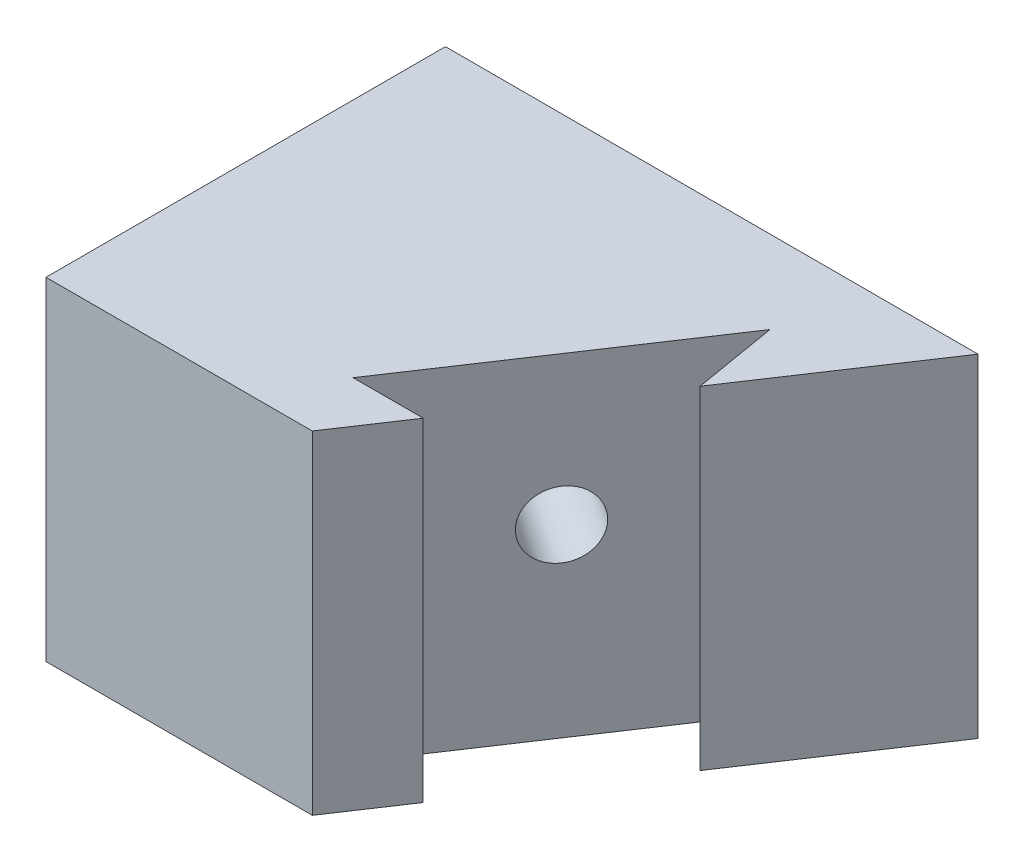
ISO-10303-21;
HEADER;
FILE_DESCRIPTION(('STEP AP214'),'2;1');
FILE_NAME('part.step','',(''),(''),'','','');
FILE_SCHEMA(('AUTOMOTIVE_DESIGN { 1 0 10303 214 1 1 1 1 }'));
ENDSEC;
DATA;
#1=APPLICATION_CONTEXT('core data for automotive mechanical design processes');
#2=APPLICATION_PROTOCOL_DEFINITION('international standard','automotive_design',2000,#1);
#3=PRODUCT_CONTEXT('',#1,'mechanical');
#4=PRODUCT('Part','Part','',(#3));
#5=PRODUCT_RELATED_PRODUCT_CATEGORY('part','',(#4));
#6=PRODUCT_DEFINITION_FORMATION('','',#4);
#7=PRODUCT_DEFINITION_CONTEXT('part definition',#1,'design');
#8=PRODUCT_DEFINITION('design','',#6,#7);
#9=PRODUCT_DEFINITION_SHAPE('','',#8);
#10=(LENGTH_UNIT() NAMED_UNIT(*) SI_UNIT(.MILLI.,.METRE.));
#11=(NAMED_UNIT(*) PLANE_ANGLE_UNIT() SI_UNIT($,.RADIAN.));
#12=(NAMED_UNIT(*) SI_UNIT($,.STERADIAN.) SOLID_ANGLE_UNIT());
#13=UNCERTAINTY_MEASURE_WITH_UNIT(LENGTH_MEASURE(1.E-05),#10,'distance_accuracy_value','');
#14=(GEOMETRIC_REPRESENTATION_CONTEXT(3) GLOBAL_UNCERTAINTY_ASSIGNED_CONTEXT((#13)) GLOBAL_UNIT_ASSIGNED_CONTEXT((#10,
#11,#12)) REPRESENTATION_CONTEXT('',''));
#15=CARTESIAN_POINT('',(0.,0.,0.));
#16=DIRECTION('',(0.,0.,1.));
#17=DIRECTION('',(1.,0.,0.));
#18=AXIS2_PLACEMENT_3D('',#15,#16,#17);
#19=CARTESIAN_POINT('',(0.,0.,30.));
#20=DIRECTION('',(0.832050294337844,0.,0.554700196225229));
#21=DIRECTION('',(0.554700196225229,0.,-0.832050294337844));
#22=AXIS2_PLACEMENT_3D('',#19,#20,#21);
#23=PLANE('',#22);
#24=DIRECTION('',(0.,1.,0.));
#25=VECTOR('',#24,1.);
#26=CARTESIAN_POINT('',(6.66666666666667,0.,20.));
#27=LINE('',#26,#25);
#28=CARTESIAN_POINT('',(6.66666666666667,0.,20.));
#29=VERTEX_POINT('',#28);
#30=CARTESIAN_POINT('',(6.66666666666667,50.,20.));
#31=VERTEX_POINT('',#30);
#32=EDGE_CURVE('E157',#29,#31,#27,.T.);
#33=ORIENTED_EDGE('',*,*,#32,.T.);
#34=DIRECTION('',(0.554700196225229,0.,-0.832050294337844));
#35=VECTOR('',#34,1.);
#36=CARTESIAN_POINT('',(0.,50.,30.));
#37=LINE('',#36,#35);
#38=CARTESIAN_POINT('',(0.,50.,30.));
#39=VERTEX_POINT('',#38);
#40=EDGE_CURVE('E143',#39,#31,#37,.T.);
#41=ORIENTED_EDGE('',*,*,#40,.F.);
#42=DIRECTION('',(0.,1.,0.));
#43=VECTOR('',#42,1.);
#44=CARTESIAN_POINT('',(0.,0.,30.));
#45=LINE('',#44,#43);
#46=CARTESIAN_POINT('',(0.,0.,30.));
#47=VERTEX_POINT('',#46);
#48=EDGE_CURVE('E135',#47,#39,#45,.T.);
#49=ORIENTED_EDGE('',*,*,#48,.F.);
#50=DIRECTION('',(0.554700196225229,0.,-0.832050294337844));
#51=VECTOR('',#50,1.);
#52=CARTESIAN_POINT('',(0.,0.,30.));
#53=LINE('',#52,#51);
#54=EDGE_CURVE('E142',#47,#29,#53,.T.);
#55=ORIENTED_EDGE('',*,*,#54,.T.);
#56=EDGE_LOOP('',(#33,#41,#49,#55));
#57=FACE_BOUND('',#56,.T.);
#58=ADVANCED_FACE('F36',(#57),#23,.T.);
#59=CARTESIAN_POINT('',(-40.,50.,30.));
#60=DIRECTION('',(0.,0.,-1.));
#61=DIRECTION('',(-1.,0.,0.));
#62=AXIS2_PLACEMENT_3D('',#59,#60,#61);
#63=PLANE('',#62);
#64=ORIENTED_EDGE('',*,*,#48,.T.);
#65=DIRECTION('',(1.,0.,0.));
#66=VECTOR('',#65,1.);
#67=CARTESIAN_POINT('',(-40.,50.,30.));
#68=LINE('',#67,#66);
#69=CARTESIAN_POINT('',(-40.,50.,30.));
#70=VERTEX_POINT('',#69);
#71=EDGE_CURVE('E126',#70,#39,#68,.T.);
#72=ORIENTED_EDGE('',*,*,#71,.F.);
#73=DIRECTION('',(0.,-1.,0.));
#74=VECTOR('',#73,1.);
#75=CARTESIAN_POINT('',(-40.,50.,30.));
#76=LINE('',#75,#74);
#77=CARTESIAN_POINT('',(-40.,0.,30.));
#78=VERTEX_POINT('',#77);
#79=EDGE_CURVE('E122',#70,#78,#76,.T.);
#80=ORIENTED_EDGE('',*,*,#79,.T.);
#81=DIRECTION('',(1.,0.,0.));
#82=VECTOR('',#81,1.);
#83=CARTESIAN_POINT('',(-40.,0.,30.));
#84=LINE('',#83,#82);
#85=EDGE_CURVE('E127',#78,#47,#84,.T.);
#86=ORIENTED_EDGE('',*,*,#85,.T.);
#87=EDGE_LOOP('',(#64,#72,#80,#86));
#88=FACE_BOUND('',#87,.T.);
#89=ADVANCED_FACE('F198',(#88),#63,.F.);
#90=CARTESIAN_POINT('',(0.,50.,0.));
#91=DIRECTION('',(0.,1.,0.));
#92=DIRECTION('',(0.,0.,1.));
#93=AXIS2_PLACEMENT_3D('',#90,#91,#92);
#94=PLANE('',#93);
#95=DIRECTION('',(1.,0.,0.));
#96=VECTOR('',#95,1.);
#97=CARTESIAN_POINT('',(-3.87129213186939,50.,20.));
#98=LINE('',#97,#96);
#99=CARTESIAN_POINT('',(-3.87129213186939,50.,20.));
#100=VERTEX_POINT('',#99);
#101=EDGE_CURVE('E160',#100,#31,#98,.T.);
#102=ORIENTED_EDGE('',*,*,#101,.F.);
#103=DIRECTION('',(-0.554700196225229,0.,0.832050294337844));
#104=VECTOR('',#103,1.);
#105=CARTESIAN_POINT('',(21.1779297543231,50.,-17.5738328292888));
#106=LINE('',#105,#104);
#107=CARTESIAN_POINT('',(21.1779297543231,50.,-17.5738328292888));
#108=VERTEX_POINT('',#107);
#109=EDGE_CURVE('E162',#108,#100,#106,.T.);
#110=ORIENTED_EDGE('',*,*,#109,.F.);
#111=DIRECTION('',(-0.166504836703689,0.,-0.986040637780349));
#112=VECTOR('',#111,1.);
#113=CARTESIAN_POINT('',(23.3076725534235,50.,-4.96150883013532));
#114=LINE('',#113,#112);
#115=CARTESIAN_POINT('',(23.3076725534235,50.,-4.96150883013532));
#116=VERTEX_POINT('',#115);
#117=EDGE_CURVE('E117',#116,#108,#114,.T.);
#118=ORIENTED_EDGE('',*,*,#117,.F.);
#119=CARTESIAN_POINT('',(40.,50.,-30.));
#120=VERTEX_POINT('',#119);
#121=EDGE_CURVE('E147',#116,#120,#37,.T.);
#122=ORIENTED_EDGE('',*,*,#121,.T.);
#123=DIRECTION('',(-1.,0.,0.));
#124=VECTOR('',#123,1.);
#125=CARTESIAN_POINT('',(-40.,50.,-30.));
#126=LINE('',#125,#124);
#127=CARTESIAN_POINT('',(-40.,50.,-30.));
#128=VERTEX_POINT('',#127);
#129=EDGE_CURVE('E130',#120,#128,#126,.T.);
#130=ORIENTED_EDGE('',*,*,#129,.T.);
#131=DIRECTION('',(0.,0.,1.));
#132=VECTOR('',#131,1.);
#133=CARTESIAN_POINT('',(-40.,50.,-30.));
#134=LINE('',#133,#132);
#135=EDGE_CURVE('E121',#128,#70,#134,.T.);
#136=ORIENTED_EDGE('',*,*,#135,.T.);
#137=ORIENTED_EDGE('',*,*,#71,.T.);
#138=ORIENTED_EDGE('',*,*,#40,.T.);
#139=EDGE_LOOP('',(#102,#110,#118,#122,#130,#136,#137,#138));
#140=FACE_BOUND('',#139,.T.);
#141=ADVANCED_FACE('F189',(#140),#94,.T.);
#142=CARTESIAN_POINT('',(0.,0.,0.));
#143=DIRECTION('',(0.,1.,0.));
#144=DIRECTION('',(0.,0.,1.));
#145=AXIS2_PLACEMENT_3D('',#142,#143,#144);
#146=PLANE('',#145);
#147=DIRECTION('',(-0.554700196225229,0.,0.832050294337844));
#148=VECTOR('',#147,1.);
#149=CARTESIAN_POINT('',(21.1779297543231,0.,-17.5738328292888));
#150=LINE('',#149,#148);
#151=CARTESIAN_POINT('',(21.1779297543231,0.,-17.5738328292888));
#152=VERTEX_POINT('',#151);
#153=CARTESIAN_POINT('',(-3.87129213186939,0.,20.));
#154=VERTEX_POINT('',#153);
#155=EDGE_CURVE('E169',#152,#154,#150,.T.);
#156=ORIENTED_EDGE('',*,*,#155,.T.);
#157=DIRECTION('',(1.,0.,0.));
#158=VECTOR('',#157,1.);
#159=CARTESIAN_POINT('',(-3.87129213186939,0.,20.));
#160=LINE('',#159,#158);
#161=EDGE_CURVE('E153',#154,#29,#160,.T.);
#162=ORIENTED_EDGE('',*,*,#161,.T.);
#163=ORIENTED_EDGE('',*,*,#54,.F.);
#164=ORIENTED_EDGE('',*,*,#85,.F.);
#165=DIRECTION('',(0.,0.,1.));
#166=VECTOR('',#165,1.);
#167=CARTESIAN_POINT('',(-40.,0.,-30.));
#168=LINE('',#167,#166);
#169=CARTESIAN_POINT('',(-40.,0.,-30.));
#170=VERTEX_POINT('',#169);
#171=EDGE_CURVE('E131',#170,#78,#168,.T.);
#172=ORIENTED_EDGE('',*,*,#171,.F.);
#173=DIRECTION('',(-1.,0.,0.));
#174=VECTOR('',#173,1.);
#175=CARTESIAN_POINT('',(-40.,0.,-30.));
#176=LINE('',#175,#174);
#177=CARTESIAN_POINT('',(40.,0.,-30.));
#178=VERTEX_POINT('',#177);
#179=EDGE_CURVE('E133',#178,#170,#176,.T.);
#180=ORIENTED_EDGE('',*,*,#179,.F.);
#181=CARTESIAN_POINT('',(23.3076725534235,0.,-4.96150883013533));
#182=VERTEX_POINT('',#181);
#183=EDGE_CURVE('E146',#182,#178,#53,.T.);
#184=ORIENTED_EDGE('',*,*,#183,.F.);
#185=DIRECTION('',(-0.166504836703689,0.,-0.986040637780349));
#186=VECTOR('',#185,1.);
#187=CARTESIAN_POINT('',(23.3076725534235,0.,-4.96150883013532));
#188=LINE('',#187,#186);
#189=EDGE_CURVE('E58',#182,#152,#188,.T.);
#190=ORIENTED_EDGE('',*,*,#189,.T.);
#191=EDGE_LOOP('',(#156,#162,#163,#164,#172,#180,#184,#190));
#192=FACE_BOUND('',#191,.T.);
#193=ADVANCED_FACE('F195',(#192),#146,.F.);
#194=CARTESIAN_POINT('',(-40.,50.,-30.));
#195=DIRECTION('',(0.,0.,1.));
#196=DIRECTION('',(1.,0.,0.));
#197=AXIS2_PLACEMENT_3D('',#194,#195,#196);
#198=PLANE('',#197);
#199=DIRECTION('',(0.,-1.,0.));
#200=VECTOR('',#199,1.);
#201=CARTESIAN_POINT('',(-40.,50.,-30.));
#202=LINE('',#201,#200);
#203=CARTESIAN_POINT('',(-40.,22.8620856578514,-30.));
#204=VERTEX_POINT('',#203);
#205=EDGE_CURVE('E116',#204,#170,#202,.T.);
#206=ORIENTED_EDGE('',*,*,#205,.F.);
#207=CARTESIAN_POINT('',(-38.1663065668065,27.7575331000577,-30.));
#208=DIRECTION('',(0.,0.,1.));
#209=DIRECTION('',(1.,0.,0.));
#210=AXIS2_PLACEMENT_3D('',#207,#208,#209);
#211=ELLIPSE('',#210,9.01387818865997,5.);
#212=CARTESIAN_POINT('',(-40.,32.652980542264,-30.));
#213=VERTEX_POINT('',#212);
#214=EDGE_CURVE('E50',#204,#213,#211,.T.);
#215=ORIENTED_EDGE('',*,*,#214,.T.);
#216=EDGE_CURVE('E44',#128,#213,#202,.T.);
#217=ORIENTED_EDGE('',*,*,#216,.F.);
#218=ORIENTED_EDGE('',*,*,#129,.F.);
#219=DIRECTION('',(0.,-1.,0.));
#220=VECTOR('',#219,1.);
#221=CARTESIAN_POINT('',(40.,50.,-30.));
#222=LINE('',#221,#220);
#223=EDGE_CURVE('E11',#120,#178,#222,.T.);
#224=ORIENTED_EDGE('',*,*,#223,.T.);
#225=ORIENTED_EDGE('',*,*,#179,.T.);
#226=EDGE_LOOP('',(#206,#215,#217,#218,#224,#225));
#227=FACE_BOUND('',#226,.T.);
#228=ADVANCED_FACE('F38',(#227),#198,.F.);
#229=CARTESIAN_POINT('',(-40.,50.,-30.));
#230=DIRECTION('',(1.,0.,0.));
#231=DIRECTION('',(0.,0.,-1.));
#232=AXIS2_PLACEMENT_3D('',#229,#230,#231);
#233=PLANE('',#232);
#234=ORIENTED_EDGE('',*,*,#216,.T.);
#235=CARTESIAN_POINT('',(-40.,27.7575331000577,-31.2224622887957));
#236=DIRECTION('',(1.,0.,0.));
#237=DIRECTION('',(0.,0.,1.));
#238=AXIS2_PLACEMENT_3D('',#235,#236,#237);
#239=ELLIPSE('',#238,6.00925212577332,5.);
#240=EDGE_CURVE('E104',#213,#204,#239,.T.);
#241=ORIENTED_EDGE('',*,*,#240,.T.);
#242=ORIENTED_EDGE('',*,*,#205,.T.);
#243=ORIENTED_EDGE('',*,*,#171,.T.);
#244=ORIENTED_EDGE('',*,*,#79,.F.);
#245=ORIENTED_EDGE('',*,*,#135,.F.);
#246=EDGE_LOOP('',(#234,#241,#242,#243,#244,#245));
#247=FACE_BOUND('',#246,.T.);
#248=ADVANCED_FACE('F119',(#247),#233,.F.);
#249=DIRECTION('',(0.,1.,0.));
#250=VECTOR('',#249,1.);
#251=CARTESIAN_POINT('',(23.3076725534235,0.,-4.96150883013532));
#252=LINE('',#251,#250);
#253=EDGE_CURVE('E150',#182,#116,#252,.T.);
#254=ORIENTED_EDGE('',*,*,#253,.F.);
#255=ORIENTED_EDGE('',*,*,#183,.T.);
#256=ORIENTED_EDGE('',*,*,#223,.F.);
#257=ORIENTED_EDGE('',*,*,#121,.F.);
#258=EDGE_LOOP('',(#254,#255,#256,#257));
#259=FACE_BOUND('',#258,.T.);
#260=ADVANCED_FACE('F205',(#259),#23,.T.);
#261=CARTESIAN_POINT('',(-3.87129213186939,0.,20.));
#262=DIRECTION('',(0.,0.,1.));
#263=DIRECTION('',(1.,0.,0.));
#264=AXIS2_PLACEMENT_3D('',#261,#262,#263);
#265=PLANE('',#264);
#266=ORIENTED_EDGE('',*,*,#101,.T.);
#267=ORIENTED_EDGE('',*,*,#32,.F.);
#268=ORIENTED_EDGE('',*,*,#161,.F.);
#269=DIRECTION('',(0.,1.,0.));
#270=VECTOR('',#269,1.);
#271=CARTESIAN_POINT('',(-3.87129213186939,0.,20.));
#272=LINE('',#271,#270);
#273=EDGE_CURVE('E155',#154,#100,#272,.T.);
#274=ORIENTED_EDGE('',*,*,#273,.T.);
#275=EDGE_LOOP('',(#266,#267,#268,#274));
#276=FACE_BOUND('',#275,.T.);
#277=ADVANCED_FACE('F181',(#276),#265,.F.);
#278=CARTESIAN_POINT('',(21.1779297543231,0.,-17.5738328292888));
#279=DIRECTION('',(-0.832050294337844,0.,-0.554700196225229));
#280=DIRECTION('',(-0.554700196225229,0.,0.832050294337844));
#281=AXIS2_PLACEMENT_3D('',#278,#279,#280);
#282=PLANE('',#281);
#283=CARTESIAN_POINT('',(8.65331881122688,27.7575331000577,1.2130835853556));
#284=DIRECTION('',(0.832050294337844,0.,0.554700196225229));
#285=DIRECTION('',(0.554700196225229,0.,-0.832050294337844));
#286=AXIS2_PLACEMENT_3D('',#283,#284,#285);
#287=CIRCLE('',#286,5.);
#288=CARTESIAN_POINT('',(11.426819792353,27.7575331000577,-2.94716788633362));
#289=VERTEX_POINT('',#288);
#290=EDGE_CURVE('E109',#289,#289,#287,.T.);
#291=ORIENTED_EDGE('',*,*,#290,.F.);
#292=EDGE_LOOP('',(#291));
#293=FACE_BOUND('',#292,.T.);
#294=ORIENTED_EDGE('',*,*,#109,.T.);
#295=ORIENTED_EDGE('',*,*,#273,.F.);
#296=ORIENTED_EDGE('',*,*,#155,.F.);
#297=DIRECTION('',(0.,1.,0.));
#298=VECTOR('',#297,1.);
#299=CARTESIAN_POINT('',(21.1779297543231,0.,-17.5738328292888));
#300=LINE('',#299,#298);
#301=EDGE_CURVE('E152',#152,#108,#300,.T.);
#302=ORIENTED_EDGE('',*,*,#301,.T.);
#303=EDGE_LOOP('',(#294,#295,#296,#302));
#304=FACE_BOUND('',#303,.T.);
#305=ADVANCED_FACE('F177',(#293,#304),#282,.F.);
#306=CARTESIAN_POINT('',(23.3076725534235,0.,-4.96150883013532));
#307=DIRECTION('',(0.986040637780349,0.,-0.166504836703689));
#308=DIRECTION('',(-0.166504836703689,0.,-0.986040637780349));
#309=AXIS2_PLACEMENT_3D('',#306,#307,#308);
#310=PLANE('',#309);
#311=ORIENTED_EDGE('',*,*,#117,.T.);
#312=ORIENTED_EDGE('',*,*,#301,.F.);
#313=ORIENTED_EDGE('',*,*,#189,.F.);
#314=ORIENTED_EDGE('',*,*,#253,.T.);
#315=EDGE_LOOP('',(#311,#312,#313,#314));
#316=FACE_BOUND('',#315,.T.);
#317=ADVANCED_FACE('F180',(#316),#310,.F.);
#318=CARTESIAN_POINT('',(-39.4357866359405,27.7575331000577,-30.8463200460893));
#319=DIRECTION('',(0.832050294337844,0.,0.554700196225229));
#320=DIRECTION('',(0.554700196225229,0.,-0.832050294337844));
#321=AXIS2_PLACEMENT_3D('',#318,#319,#320);
#322=CYLINDRICAL_SURFACE('',#321,5.);
#323=ORIENTED_EDGE('',*,*,#290,.T.);
#324=EDGE_LOOP('',(#323));
#325=FACE_BOUND('',#324,.T.);
#326=ORIENTED_EDGE('',*,*,#240,.F.);
#327=ORIENTED_EDGE('',*,*,#214,.F.);
#328=EDGE_LOOP('',(#326,#327));
#329=FACE_BOUND('',#328,.T.);
#330=ADVANCED_FACE('F105',(#325,#329),#322,.F.);
#331=CLOSED_SHELL('',(#58,#89,#141,#193,#228,#248,#260,#277,#305,#317,#330));
#332=MANIFOLD_SOLID_BREP('B2',#331);
#333=ADVANCED_BREP_SHAPE_REPRESENTATION('',(#18,#332),#14);
#334=SHAPE_DEFINITION_REPRESENTATION(#9,#333);
ENDSEC;
END-ISO-10303-21;
